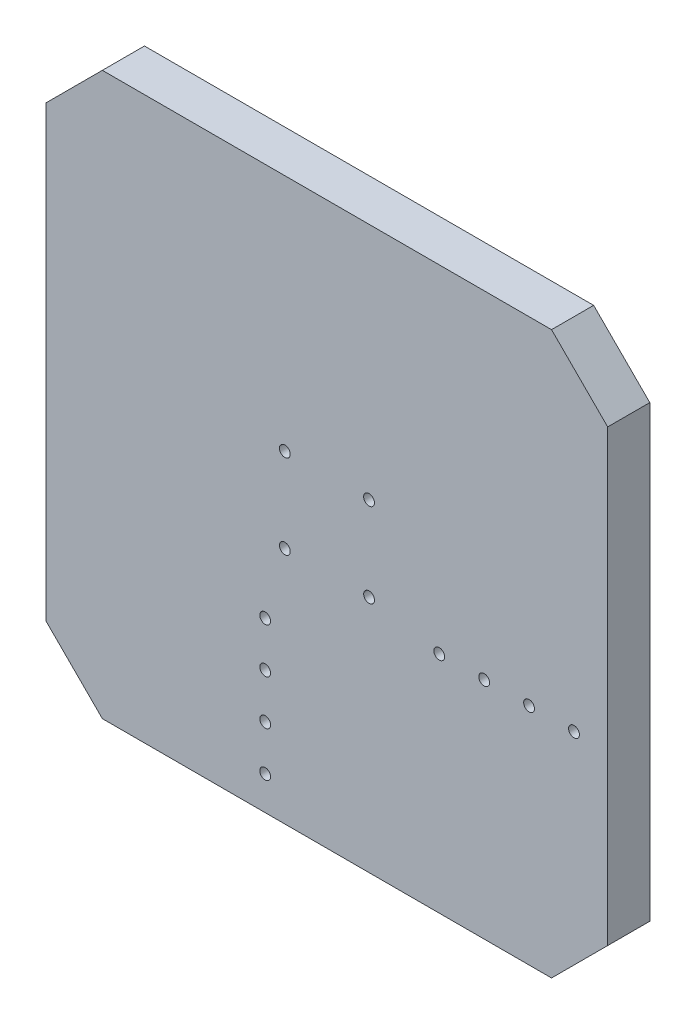
ISO-10303-21;
HEADER;
FILE_DESCRIPTION(('STEP AP214'),'2;1');
FILE_NAME('part.step','',(''),(''),'','','');
FILE_SCHEMA(('AUTOMOTIVE_DESIGN { 1 0 10303 214 1 1 1 1 }'));
ENDSEC;
DATA;
#1=APPLICATION_CONTEXT('core data for automotive mechanical design processes');
#2=APPLICATION_PROTOCOL_DEFINITION('international standard','automotive_design',2000,#1);
#3=PRODUCT_CONTEXT('',#1,'mechanical');
#4=PRODUCT('Part','Part','',(#3));
#5=PRODUCT_RELATED_PRODUCT_CATEGORY('part','',(#4));
#6=PRODUCT_DEFINITION_FORMATION('','',#4);
#7=PRODUCT_DEFINITION_CONTEXT('part definition',#1,'design');
#8=PRODUCT_DEFINITION('design','',#6,#7);
#9=PRODUCT_DEFINITION_SHAPE('','',#8);
#10=(LENGTH_UNIT() NAMED_UNIT(*) SI_UNIT(.MILLI.,.METRE.));
#11=(NAMED_UNIT(*) PLANE_ANGLE_UNIT() SI_UNIT($,.RADIAN.));
#12=(NAMED_UNIT(*) SI_UNIT($,.STERADIAN.) SOLID_ANGLE_UNIT());
#13=UNCERTAINTY_MEASURE_WITH_UNIT(LENGTH_MEASURE(1.E-05),#10,'distance_accuracy_value','');
#14=(GEOMETRIC_REPRESENTATION_CONTEXT(3) GLOBAL_UNCERTAINTY_ASSIGNED_CONTEXT((#13)) GLOBAL_UNIT_ASSIGNED_CONTEXT((#10,
#11,#12)) REPRESENTATION_CONTEXT('',''));
#15=CARTESIAN_POINT('',(0.,0.,0.));
#16=DIRECTION('',(0.,0.,1.));
#17=DIRECTION('',(1.,0.,0.));
#18=AXIS2_PLACEMENT_3D('',#15,#16,#17);
#19=CARTESIAN_POINT('',(100.,-100.,15.));
#20=DIRECTION('',(-1.,0.,0.));
#21=DIRECTION('',(0.,0.,1.));
#22=AXIS2_PLACEMENT_3D('',#19,#20,#21);
#23=PLANE('',#22);
#24=DIRECTION('',(0.,1.,0.));
#25=VECTOR('',#24,1.);
#26=CARTESIAN_POINT('',(100.,-100.,0.));
#27=LINE('',#26,#25);
#28=CARTESIAN_POINT('',(100.,-80.,0.));
#29=VERTEX_POINT('',#28);
#30=CARTESIAN_POINT('',(100.,80.,0.));
#31=VERTEX_POINT('',#30);
#32=EDGE_CURVE('E168',#29,#31,#27,.T.);
#33=ORIENTED_EDGE('',*,*,#32,.T.);
#34=DIRECTION('',(0.,0.,1.));
#35=VECTOR('',#34,1.);
#36=CARTESIAN_POINT('',(100.,80.,15.));
#37=LINE('',#36,#35);
#38=CARTESIAN_POINT('',(100.,80.,15.));
#39=VERTEX_POINT('',#38);
#40=EDGE_CURVE('E11',#31,#39,#37,.T.);
#41=ORIENTED_EDGE('',*,*,#40,.T.);
#42=DIRECTION('',(0.,1.,0.));
#43=VECTOR('',#42,1.);
#44=CARTESIAN_POINT('',(100.,-100.,15.));
#45=LINE('',#44,#43);
#46=CARTESIAN_POINT('',(100.,-80.,15.));
#47=VERTEX_POINT('',#46);
#48=EDGE_CURVE('E136',#47,#39,#45,.T.);
#49=ORIENTED_EDGE('',*,*,#48,.F.);
#50=DIRECTION('',(0.,0.,-1.));
#51=VECTOR('',#50,1.);
#52=CARTESIAN_POINT('',(100.,-80.,15.));
#53=LINE('',#52,#51);
#54=EDGE_CURVE('E52',#47,#29,#53,.T.);
#55=ORIENTED_EDGE('',*,*,#54,.T.);
#56=EDGE_LOOP('',(#33,#41,#49,#55));
#57=FACE_BOUND('',#56,.T.);
#58=ADVANCED_FACE('F43',(#57),#23,.F.);
#59=CARTESIAN_POINT('',(-100.,100.,15.));
#60=DIRECTION('',(0.,-1.,0.));
#61=DIRECTION('',(0.,0.,-1.));
#62=AXIS2_PLACEMENT_3D('',#59,#60,#61);
#63=PLANE('',#62);
#64=DIRECTION('',(-1.,0.,0.));
#65=VECTOR('',#64,1.);
#66=CARTESIAN_POINT('',(-100.,100.,0.));
#67=LINE('',#66,#65);
#68=CARTESIAN_POINT('',(80.,100.,0.));
#69=VERTEX_POINT('',#68);
#70=CARTESIAN_POINT('',(-79.9999999999999,100.,0.));
#71=VERTEX_POINT('',#70);
#72=EDGE_CURVE('E141',#69,#71,#67,.T.);
#73=ORIENTED_EDGE('',*,*,#72,.T.);
#74=DIRECTION('',(0.,0.,1.));
#75=VECTOR('',#74,1.);
#76=CARTESIAN_POINT('',(-79.9999999999999,100.,15.));
#77=LINE('',#76,#75);
#78=CARTESIAN_POINT('',(-79.9999999999999,100.,15.));
#79=VERTEX_POINT('',#78);
#80=EDGE_CURVE('E59',#71,#79,#77,.T.);
#81=ORIENTED_EDGE('',*,*,#80,.T.);
#82=DIRECTION('',(-1.,0.,0.));
#83=VECTOR('',#82,1.);
#84=CARTESIAN_POINT('',(-100.,100.,15.));
#85=LINE('',#84,#83);
#86=CARTESIAN_POINT('',(80.,100.,15.));
#87=VERTEX_POINT('',#86);
#88=EDGE_CURVE('E139',#87,#79,#85,.T.);
#89=ORIENTED_EDGE('',*,*,#88,.F.);
#90=DIRECTION('',(0.,0.,-1.));
#91=VECTOR('',#90,1.);
#92=CARTESIAN_POINT('',(80.,100.,15.));
#93=LINE('',#92,#91);
#94=EDGE_CURVE('E160',#87,#69,#93,.T.);
#95=ORIENTED_EDGE('',*,*,#94,.T.);
#96=EDGE_LOOP('',(#73,#81,#89,#95));
#97=FACE_BOUND('',#96,.T.);
#98=ADVANCED_FACE('F284',(#97),#63,.F.);
#99=CARTESIAN_POINT('',(-100.,-100.,15.));
#100=DIRECTION('',(1.,0.,0.));
#101=DIRECTION('',(0.,0.,-1.));
#102=AXIS2_PLACEMENT_3D('',#99,#100,#101);
#103=PLANE('',#102);
#104=DIRECTION('',(0.,-1.,0.));
#105=VECTOR('',#104,1.);
#106=CARTESIAN_POINT('',(-100.,-100.,0.));
#107=LINE('',#106,#105);
#108=CARTESIAN_POINT('',(-100.,80.,0.));
#109=VERTEX_POINT('',#108);
#110=CARTESIAN_POINT('',(-100.,-80.,0.));
#111=VERTEX_POINT('',#110);
#112=EDGE_CURVE('E137',#109,#111,#107,.T.);
#113=ORIENTED_EDGE('',*,*,#112,.T.);
#114=DIRECTION('',(0.,0.,1.));
#115=VECTOR('',#114,1.);
#116=CARTESIAN_POINT('',(-100.,-80.,15.));
#117=LINE('',#116,#115);
#118=CARTESIAN_POINT('',(-100.,-80.,15.));
#119=VERTEX_POINT('',#118);
#120=EDGE_CURVE('E115',#111,#119,#117,.T.);
#121=ORIENTED_EDGE('',*,*,#120,.T.);
#122=DIRECTION('',(0.,-1.,0.));
#123=VECTOR('',#122,1.);
#124=CARTESIAN_POINT('',(-100.,-100.,15.));
#125=LINE('',#124,#123);
#126=CARTESIAN_POINT('',(-100.,80.,15.));
#127=VERTEX_POINT('',#126);
#128=EDGE_CURVE('E180',#127,#119,#125,.T.);
#129=ORIENTED_EDGE('',*,*,#128,.F.);
#130=DIRECTION('',(0.,0.,-1.));
#131=VECTOR('',#130,1.);
#132=CARTESIAN_POINT('',(-100.,80.,15.));
#133=LINE('',#132,#131);
#134=EDGE_CURVE('E120',#127,#109,#133,.T.);
#135=ORIENTED_EDGE('',*,*,#134,.T.);
#136=EDGE_LOOP('',(#113,#121,#129,#135));
#137=FACE_BOUND('',#136,.T.);
#138=ADVANCED_FACE('F281',(#137),#103,.F.);
#139=CARTESIAN_POINT('',(-100.,-100.,15.));
#140=DIRECTION('',(0.,1.,0.));
#141=DIRECTION('',(0.,0.,1.));
#142=AXIS2_PLACEMENT_3D('',#139,#140,#141);
#143=PLANE('',#142);
#144=DIRECTION('',(1.,0.,0.));
#145=VECTOR('',#144,1.);
#146=CARTESIAN_POINT('',(-100.,-100.,15.));
#147=LINE('',#146,#145);
#148=CARTESIAN_POINT('',(-80.,-100.,15.));
#149=VERTEX_POINT('',#148);
#150=CARTESIAN_POINT('',(79.9999999999999,-100.,15.));
#151=VERTEX_POINT('',#150);
#152=EDGE_CURVE('E130',#149,#151,#147,.T.);
#153=ORIENTED_EDGE('',*,*,#152,.F.);
#154=DIRECTION('',(0.,0.,-1.));
#155=VECTOR('',#154,1.);
#156=CARTESIAN_POINT('',(-80.,-100.,15.));
#157=LINE('',#156,#155);
#158=CARTESIAN_POINT('',(-80.,-100.,0.));
#159=VERTEX_POINT('',#158);
#160=EDGE_CURVE('E114',#149,#159,#157,.T.);
#161=ORIENTED_EDGE('',*,*,#160,.T.);
#162=DIRECTION('',(1.,0.,0.));
#163=VECTOR('',#162,1.);
#164=CARTESIAN_POINT('',(-100.,-100.,0.));
#165=LINE('',#164,#163);
#166=CARTESIAN_POINT('',(79.9999999999999,-100.,0.));
#167=VERTEX_POINT('',#166);
#168=EDGE_CURVE('E127',#159,#167,#165,.T.);
#169=ORIENTED_EDGE('',*,*,#168,.T.);
#170=DIRECTION('',(0.,0.,1.));
#171=VECTOR('',#170,1.);
#172=CARTESIAN_POINT('',(79.9999999999999,-100.,15.));
#173=LINE('',#172,#171);
#174=EDGE_CURVE('E132',#167,#151,#173,.T.);
#175=ORIENTED_EDGE('',*,*,#174,.T.);
#176=EDGE_LOOP('',(#153,#161,#169,#175));
#177=FACE_BOUND('',#176,.T.);
#178=ADVANCED_FACE('F126',(#177),#143,.F.);
#179=CARTESIAN_POINT('',(0.,0.,15.));
#180=DIRECTION('',(0.,0.,-1.));
#181=DIRECTION('',(-1.,0.,0.));
#182=AXIS2_PLACEMENT_3D('',#179,#180,#181);
#183=PLANE('',#182);
#184=CARTESIAN_POINT('',(-15.,15.,15.));
#185=DIRECTION('',(0.,0.,1.));
#186=DIRECTION('',(-1.,0.,0.));
#187=AXIS2_PLACEMENT_3D('',#184,#185,#186);
#188=CIRCLE('',#187,1.92500000000001);
#189=CARTESIAN_POINT('',(-16.925,15.,15.));
#190=VERTEX_POINT('',#189);
#191=EDGE_CURVE('E238',#190,#190,#188,.T.);
#192=ORIENTED_EDGE('',*,*,#191,.F.);
#193=EDGE_LOOP('',(#192));
#194=FACE_BOUND('',#193,.T.);
#195=CARTESIAN_POINT('',(-15.,-15.,15.));
#196=DIRECTION('',(0.,0.,1.));
#197=DIRECTION('',(1.,0.,0.));
#198=AXIS2_PLACEMENT_3D('',#195,#196,#197);
#199=CIRCLE('',#198,1.92499999999999);
#200=CARTESIAN_POINT('',(-13.075,-15.,15.));
#201=VERTEX_POINT('',#200);
#202=EDGE_CURVE('E244',#201,#201,#199,.T.);
#203=ORIENTED_EDGE('',*,*,#202,.F.);
#204=EDGE_LOOP('',(#203));
#205=FACE_BOUND('',#204,.T.);
#206=CARTESIAN_POINT('',(15.,-15.,15.));
#207=DIRECTION('',(0.,0.,1.));
#208=DIRECTION('',(-1.,0.,0.));
#209=AXIS2_PLACEMENT_3D('',#206,#207,#208);
#210=CIRCLE('',#209,1.925);
#211=CARTESIAN_POINT('',(13.075,-15.,15.));
#212=VERTEX_POINT('',#211);
#213=EDGE_CURVE('E232',#212,#212,#210,.T.);
#214=ORIENTED_EDGE('',*,*,#213,.F.);
#215=EDGE_LOOP('',(#214));
#216=FACE_BOUND('',#215,.T.);
#217=CARTESIAN_POINT('',(15.,15.,15.));
#218=DIRECTION('',(0.,0.,1.));
#219=DIRECTION('',(1.,0.,0.));
#220=AXIS2_PLACEMENT_3D('',#217,#218,#219);
#221=CIRCLE('',#220,1.925);
#222=CARTESIAN_POINT('',(16.925,15.,15.));
#223=VERTEX_POINT('',#222);
#224=EDGE_CURVE('E229',#223,#223,#221,.T.);
#225=ORIENTED_EDGE('',*,*,#224,.F.);
#226=EDGE_LOOP('',(#225));
#227=FACE_BOUND('',#226,.T.);
#228=CARTESIAN_POINT('',(88.,-20.,15.));
#229=DIRECTION('',(0.,0.,1.));
#230=DIRECTION('',(1.,0.,0.));
#231=AXIS2_PLACEMENT_3D('',#228,#229,#230);
#232=CIRCLE('',#231,1.925);
#233=CARTESIAN_POINT('',(89.925,-20.,15.));
#234=VERTEX_POINT('',#233);
#235=EDGE_CURVE('E224',#234,#234,#232,.T.);
#236=ORIENTED_EDGE('',*,*,#235,.F.);
#237=EDGE_LOOP('',(#236));
#238=FACE_BOUND('',#237,.T.);
#239=CARTESIAN_POINT('',(72.,-20.0000000000001,15.));
#240=DIRECTION('',(0.,0.,1.));
#241=DIRECTION('',(1.,0.,0.));
#242=AXIS2_PLACEMENT_3D('',#239,#240,#241);
#243=CIRCLE('',#242,1.925);
#244=CARTESIAN_POINT('',(73.925,-20.0000000000001,15.));
#245=VERTEX_POINT('',#244);
#246=EDGE_CURVE('E221',#245,#245,#243,.T.);
#247=ORIENTED_EDGE('',*,*,#246,.F.);
#248=EDGE_LOOP('',(#247));
#249=FACE_BOUND('',#248,.T.);
#250=CARTESIAN_POINT('',(56.,-20.0000000000002,15.));
#251=DIRECTION('',(0.,0.,1.));
#252=DIRECTION('',(1.,0.,0.));
#253=AXIS2_PLACEMENT_3D('',#250,#251,#252);
#254=CIRCLE('',#253,1.925);
#255=CARTESIAN_POINT('',(57.925,-20.0000000000002,15.));
#256=VERTEX_POINT('',#255);
#257=EDGE_CURVE('E215',#256,#256,#254,.T.);
#258=ORIENTED_EDGE('',*,*,#257,.F.);
#259=EDGE_LOOP('',(#258));
#260=FACE_BOUND('',#259,.T.);
#261=CARTESIAN_POINT('',(40.,-20.0000000000004,15.));
#262=DIRECTION('',(0.,0.,1.));
#263=DIRECTION('',(1.,0.,0.));
#264=AXIS2_PLACEMENT_3D('',#261,#262,#263);
#265=CIRCLE('',#264,1.925);
#266=CARTESIAN_POINT('',(41.925,-20.0000000000004,15.));
#267=VERTEX_POINT('',#266);
#268=EDGE_CURVE('E208',#267,#267,#265,.T.);
#269=ORIENTED_EDGE('',*,*,#268,.F.);
#270=EDGE_LOOP('',(#269));
#271=FACE_BOUND('',#270,.T.);
#272=CARTESIAN_POINT('',(-22.,-88.,15.));
#273=DIRECTION('',(0.,0.,1.));
#274=DIRECTION('',(1.,0.,0.));
#275=AXIS2_PLACEMENT_3D('',#272,#273,#274);
#276=CIRCLE('',#275,1.925);
#277=CARTESIAN_POINT('',(-20.075,-88.,15.));
#278=VERTEX_POINT('',#277);
#279=EDGE_CURVE('E176',#278,#278,#276,.T.);
#280=ORIENTED_EDGE('',*,*,#279,.F.);
#281=EDGE_LOOP('',(#280));
#282=FACE_BOUND('',#281,.T.);
#283=CARTESIAN_POINT('',(-22.,-72.,15.));
#284=DIRECTION('',(0.,0.,1.));
#285=DIRECTION('',(1.,0.,0.));
#286=AXIS2_PLACEMENT_3D('',#283,#284,#285);
#287=CIRCLE('',#286,1.925);
#288=CARTESIAN_POINT('',(-20.075,-72.,15.));
#289=VERTEX_POINT('',#288);
#290=EDGE_CURVE('E200',#289,#289,#287,.T.);
#291=ORIENTED_EDGE('',*,*,#290,.F.);
#292=EDGE_LOOP('',(#291));
#293=FACE_BOUND('',#292,.T.);
#294=CARTESIAN_POINT('',(-22.,-56.,15.));
#295=DIRECTION('',(0.,0.,1.));
#296=DIRECTION('',(1.,0.,0.));
#297=AXIS2_PLACEMENT_3D('',#294,#295,#296);
#298=CIRCLE('',#297,1.925);
#299=CARTESIAN_POINT('',(-20.075,-56.,15.));
#300=VERTEX_POINT('',#299);
#301=EDGE_CURVE('E194',#300,#300,#298,.T.);
#302=ORIENTED_EDGE('',*,*,#301,.F.);
#303=EDGE_LOOP('',(#302));
#304=FACE_BOUND('',#303,.T.);
#305=CARTESIAN_POINT('',(-22.,-40.,15.));
#306=DIRECTION('',(0.,0.,1.));
#307=DIRECTION('',(1.,0.,0.));
#308=AXIS2_PLACEMENT_3D('',#305,#306,#307);
#309=CIRCLE('',#308,1.925);
#310=CARTESIAN_POINT('',(-20.075,-40.,15.));
#311=VERTEX_POINT('',#310);
#312=EDGE_CURVE('E187',#311,#311,#309,.T.);
#313=ORIENTED_EDGE('',*,*,#312,.F.);
#314=EDGE_LOOP('',(#313));
#315=FACE_BOUND('',#314,.T.);
#316=ORIENTED_EDGE('',*,*,#128,.T.);
#317=DIRECTION('',(-0.707106781186547,0.707106781186549,0.));
#318=VECTOR('',#317,1.);
#319=CARTESIAN_POINT('',(-80.,-100.,15.));
#320=LINE('',#319,#318);
#321=EDGE_CURVE('E158',#119,#149,#320,.F.);
#322=ORIENTED_EDGE('',*,*,#321,.T.);
#323=ORIENTED_EDGE('',*,*,#152,.T.);
#324=DIRECTION('',(-0.707106781186549,-0.707106781186547,0.));
#325=VECTOR('',#324,1.);
#326=CARTESIAN_POINT('',(100.,-80.,15.));
#327=LINE('',#326,#325);
#328=EDGE_CURVE('E153',#151,#47,#327,.F.);
#329=ORIENTED_EDGE('',*,*,#328,.T.);
#330=ORIENTED_EDGE('',*,*,#48,.T.);
#331=DIRECTION('',(0.707106781186547,-0.707106781186549,0.));
#332=VECTOR('',#331,1.);
#333=CARTESIAN_POINT('',(80.,100.,15.));
#334=LINE('',#333,#332);
#335=EDGE_CURVE('E66',#39,#87,#334,.F.);
#336=ORIENTED_EDGE('',*,*,#335,.T.);
#337=ORIENTED_EDGE('',*,*,#88,.T.);
#338=DIRECTION('',(0.707106781186549,0.707106781186547,0.));
#339=VECTOR('',#338,1.);
#340=CARTESIAN_POINT('',(-100.,80.,15.));
#341=LINE('',#340,#339);
#342=EDGE_CURVE('E156',#79,#127,#341,.F.);
#343=ORIENTED_EDGE('',*,*,#342,.T.);
#344=EDGE_LOOP('',(#316,#322,#323,#329,#330,#336,#337,#343));
#345=FACE_BOUND('',#344,.T.);
#346=ADVANCED_FACE('F255',(#194,#205,#216,#227,#238,#249,#260,#271,#282,#293,#304,#315,#345),
#183,.F.);
#347=CARTESIAN_POINT('',(0.,0.,0.));
#348=DIRECTION('',(0.,0.,-1.));
#349=DIRECTION('',(-1.,0.,0.));
#350=AXIS2_PLACEMENT_3D('',#347,#348,#349);
#351=PLANE('',#350);
#352=CARTESIAN_POINT('',(-15.,15.,0.));
#353=DIRECTION('',(0.,0.,1.));
#354=DIRECTION('',(-1.,0.,0.));
#355=AXIS2_PLACEMENT_3D('',#352,#353,#354);
#356=CIRCLE('',#355,1.92500000000001);
#357=CARTESIAN_POINT('',(-16.925,15.,0.));
#358=VERTEX_POINT('',#357);
#359=EDGE_CURVE('E235',#358,#358,#356,.T.);
#360=ORIENTED_EDGE('',*,*,#359,.T.);
#361=EDGE_LOOP('',(#360));
#362=FACE_BOUND('',#361,.T.);
#363=CARTESIAN_POINT('',(-15.,-15.,0.));
#364=DIRECTION('',(0.,0.,1.));
#365=DIRECTION('',(1.,0.,0.));
#366=AXIS2_PLACEMENT_3D('',#363,#364,#365);
#367=CIRCLE('',#366,1.92499999999999);
#368=CARTESIAN_POINT('',(-13.075,-15.,0.));
#369=VERTEX_POINT('',#368);
#370=EDGE_CURVE('E241',#369,#369,#367,.T.);
#371=ORIENTED_EDGE('',*,*,#370,.T.);
#372=EDGE_LOOP('',(#371));
#373=FACE_BOUND('',#372,.T.);
#374=CARTESIAN_POINT('',(15.,-15.,0.));
#375=DIRECTION('',(0.,0.,1.));
#376=DIRECTION('',(-1.,0.,0.));
#377=AXIS2_PLACEMENT_3D('',#374,#375,#376);
#378=CIRCLE('',#377,1.925);
#379=CARTESIAN_POINT('',(13.075,-15.,0.));
#380=VERTEX_POINT('',#379);
#381=EDGE_CURVE('E247',#380,#380,#378,.T.);
#382=ORIENTED_EDGE('',*,*,#381,.T.);
#383=EDGE_LOOP('',(#382));
#384=FACE_BOUND('',#383,.T.);
#385=CARTESIAN_POINT('',(15.,15.,0.));
#386=DIRECTION('',(0.,0.,1.));
#387=DIRECTION('',(1.,0.,0.));
#388=AXIS2_PLACEMENT_3D('',#385,#386,#387);
#389=CIRCLE('',#388,1.925);
#390=CARTESIAN_POINT('',(16.925,15.,0.));
#391=VERTEX_POINT('',#390);
#392=EDGE_CURVE('E209',#391,#391,#389,.T.);
#393=ORIENTED_EDGE('',*,*,#392,.T.);
#394=EDGE_LOOP('',(#393));
#395=FACE_BOUND('',#394,.T.);
#396=CARTESIAN_POINT('',(88.,-20.,0.));
#397=DIRECTION('',(0.,0.,1.));
#398=DIRECTION('',(1.,0.,0.));
#399=AXIS2_PLACEMENT_3D('',#396,#397,#398);
#400=CIRCLE('',#399,1.925);
#401=CARTESIAN_POINT('',(89.925,-20.,0.));
#402=VERTEX_POINT('',#401);
#403=EDGE_CURVE('E188',#402,#402,#400,.T.);
#404=ORIENTED_EDGE('',*,*,#403,.T.);
#405=EDGE_LOOP('',(#404));
#406=FACE_BOUND('',#405,.T.);
#407=CARTESIAN_POINT('',(72.,-20.0000000000001,0.));
#408=DIRECTION('',(0.,0.,1.));
#409=DIRECTION('',(1.,0.,0.));
#410=AXIS2_PLACEMENT_3D('',#407,#408,#409);
#411=CIRCLE('',#410,1.925);
#412=CARTESIAN_POINT('',(73.925,-20.0000000000001,0.));
#413=VERTEX_POINT('',#412);
#414=EDGE_CURVE('E218',#413,#413,#411,.T.);
#415=ORIENTED_EDGE('',*,*,#414,.T.);
#416=EDGE_LOOP('',(#415));
#417=FACE_BOUND('',#416,.T.);
#418=CARTESIAN_POINT('',(56.,-20.0000000000002,0.));
#419=DIRECTION('',(0.,0.,1.));
#420=DIRECTION('',(1.,0.,0.));
#421=AXIS2_PLACEMENT_3D('',#418,#419,#420);
#422=CIRCLE('',#421,1.925);
#423=CARTESIAN_POINT('',(57.925,-20.0000000000002,0.));
#424=VERTEX_POINT('',#423);
#425=EDGE_CURVE('E212',#424,#424,#422,.T.);
#426=ORIENTED_EDGE('',*,*,#425,.T.);
#427=EDGE_LOOP('',(#426));
#428=FACE_BOUND('',#427,.T.);
#429=CARTESIAN_POINT('',(40.,-20.0000000000004,0.));
#430=DIRECTION('',(0.,0.,1.));
#431=DIRECTION('',(1.,0.,0.));
#432=AXIS2_PLACEMENT_3D('',#429,#430,#431);
#433=CIRCLE('',#432,1.925);
#434=CARTESIAN_POINT('',(41.925,-20.0000000000004,0.));
#435=VERTEX_POINT('',#434);
#436=EDGE_CURVE('E205',#435,#435,#433,.T.);
#437=ORIENTED_EDGE('',*,*,#436,.T.);
#438=EDGE_LOOP('',(#437));
#439=FACE_BOUND('',#438,.T.);
#440=CARTESIAN_POINT('',(-22.,-88.,0.));
#441=DIRECTION('',(0.,0.,1.));
#442=DIRECTION('',(1.,0.,0.));
#443=AXIS2_PLACEMENT_3D('',#440,#441,#442);
#444=CIRCLE('',#443,1.925);
#445=CARTESIAN_POINT('',(-20.075,-88.,0.));
#446=VERTEX_POINT('',#445);
#447=EDGE_CURVE('E173',#446,#446,#444,.T.);
#448=ORIENTED_EDGE('',*,*,#447,.T.);
#449=EDGE_LOOP('',(#448));
#450=FACE_BOUND('',#449,.T.);
#451=CARTESIAN_POINT('',(-22.,-72.,0.));
#452=DIRECTION('',(0.,0.,1.));
#453=DIRECTION('',(1.,0.,0.));
#454=AXIS2_PLACEMENT_3D('',#451,#452,#453);
#455=CIRCLE('',#454,1.925);
#456=CARTESIAN_POINT('',(-20.075,-72.,0.));
#457=VERTEX_POINT('',#456);
#458=EDGE_CURVE('E197',#457,#457,#455,.T.);
#459=ORIENTED_EDGE('',*,*,#458,.T.);
#460=EDGE_LOOP('',(#459));
#461=FACE_BOUND('',#460,.T.);
#462=CARTESIAN_POINT('',(-22.,-56.,0.));
#463=DIRECTION('',(0.,0.,1.));
#464=DIRECTION('',(1.,0.,0.));
#465=AXIS2_PLACEMENT_3D('',#462,#463,#464);
#466=CIRCLE('',#465,1.925);
#467=CARTESIAN_POINT('',(-20.075,-56.,0.));
#468=VERTEX_POINT('',#467);
#469=EDGE_CURVE('E191',#468,#468,#466,.T.);
#470=ORIENTED_EDGE('',*,*,#469,.T.);
#471=EDGE_LOOP('',(#470));
#472=FACE_BOUND('',#471,.T.);
#473=CARTESIAN_POINT('',(-22.,-40.,0.));
#474=DIRECTION('',(0.,0.,1.));
#475=DIRECTION('',(1.,0.,0.));
#476=AXIS2_PLACEMENT_3D('',#473,#474,#475);
#477=CIRCLE('',#476,1.925);
#478=CARTESIAN_POINT('',(-20.075,-40.,0.));
#479=VERTEX_POINT('',#478);
#480=EDGE_CURVE('E184',#479,#479,#477,.T.);
#481=ORIENTED_EDGE('',*,*,#480,.T.);
#482=EDGE_LOOP('',(#481));
#483=FACE_BOUND('',#482,.T.);
#484=ORIENTED_EDGE('',*,*,#168,.F.);
#485=DIRECTION('',(0.707106781186547,-0.707106781186549,0.));
#486=VECTOR('',#485,1.);
#487=CARTESIAN_POINT('',(-90.0000000000001,-89.9999999999999,0.));
#488=LINE('',#487,#486);
#489=EDGE_CURVE('E110',#159,#111,#488,.F.);
#490=ORIENTED_EDGE('',*,*,#489,.T.);
#491=ORIENTED_EDGE('',*,*,#112,.F.);
#492=DIRECTION('',(-0.707106781186549,-0.707106781186547,0.));
#493=VECTOR('',#492,1.);
#494=CARTESIAN_POINT('',(-89.9999999999999,90.0000000000001,0.));
#495=LINE('',#494,#493);
#496=EDGE_CURVE('E121',#109,#71,#495,.F.);
#497=ORIENTED_EDGE('',*,*,#496,.T.);
#498=ORIENTED_EDGE('',*,*,#72,.F.);
#499=DIRECTION('',(-0.707106781186547,0.707106781186549,0.));
#500=VECTOR('',#499,1.);
#501=CARTESIAN_POINT('',(90.0000000000001,89.9999999999999,0.));
#502=LINE('',#501,#500);
#503=EDGE_CURVE('E147',#69,#31,#502,.F.);
#504=ORIENTED_EDGE('',*,*,#503,.T.);
#505=ORIENTED_EDGE('',*,*,#32,.F.);
#506=DIRECTION('',(0.707106781186549,0.707106781186547,0.));
#507=VECTOR('',#506,1.);
#508=CARTESIAN_POINT('',(89.9999999999999,-90.0000000000001,0.));
#509=LINE('',#508,#507);
#510=EDGE_CURVE('E131',#29,#167,#509,.F.);
#511=ORIENTED_EDGE('',*,*,#510,.T.);
#512=EDGE_LOOP('',(#484,#490,#491,#497,#498,#504,#505,#511));
#513=FACE_BOUND('',#512,.T.);
#514=ADVANCED_FACE('F134',(#362,#373,#384,#395,#406,#417,#428,#439,#450,#461,#472,#483,#513),
#351,.T.);
#515=CARTESIAN_POINT('',(-80.,-100.,15.));
#516=DIRECTION('',(0.707106781186548,0.707106781186546,0.));
#517=DIRECTION('',(0.,0.,-1.));
#518=AXIS2_PLACEMENT_3D('',#515,#516,#517);
#519=PLANE('',#518);
#520=ORIENTED_EDGE('',*,*,#321,.F.);
#521=ORIENTED_EDGE('',*,*,#120,.F.);
#522=ORIENTED_EDGE('',*,*,#489,.F.);
#523=ORIENTED_EDGE('',*,*,#160,.F.);
#524=EDGE_LOOP('',(#520,#521,#522,#523));
#525=FACE_BOUND('',#524,.T.);
#526=ADVANCED_FACE('F113',(#525),#519,.F.);
#527=CARTESIAN_POINT('',(-100.,80.,15.));
#528=DIRECTION('',(0.707106781186547,-0.707106781186549,0.));
#529=DIRECTION('',(0.,0.,-1.));
#530=AXIS2_PLACEMENT_3D('',#527,#528,#529);
#531=PLANE('',#530);
#532=ORIENTED_EDGE('',*,*,#342,.F.);
#533=ORIENTED_EDGE('',*,*,#80,.F.);
#534=ORIENTED_EDGE('',*,*,#496,.F.);
#535=ORIENTED_EDGE('',*,*,#134,.F.);
#536=EDGE_LOOP('',(#532,#533,#534,#535));
#537=FACE_BOUND('',#536,.T.);
#538=ADVANCED_FACE('F283',(#537),#531,.F.);
#539=CARTESIAN_POINT('',(80.,100.,15.));
#540=DIRECTION('',(-0.707106781186548,-0.707106781186546,0.));
#541=DIRECTION('',(0.,0.,-1.));
#542=AXIS2_PLACEMENT_3D('',#539,#540,#541);
#543=PLANE('',#542);
#544=ORIENTED_EDGE('',*,*,#335,.F.);
#545=ORIENTED_EDGE('',*,*,#40,.F.);
#546=ORIENTED_EDGE('',*,*,#503,.F.);
#547=ORIENTED_EDGE('',*,*,#94,.F.);
#548=EDGE_LOOP('',(#544,#545,#546,#547));
#549=FACE_BOUND('',#548,.T.);
#550=ADVANCED_FACE('F287',(#549),#543,.F.);
#551=CARTESIAN_POINT('',(100.,-80.,15.));
#552=DIRECTION('',(-0.707106781186547,0.707106781186549,0.));
#553=DIRECTION('',(0.,0.,-1.));
#554=AXIS2_PLACEMENT_3D('',#551,#552,#553);
#555=PLANE('',#554);
#556=ORIENTED_EDGE('',*,*,#328,.F.);
#557=ORIENTED_EDGE('',*,*,#174,.F.);
#558=ORIENTED_EDGE('',*,*,#510,.F.);
#559=ORIENTED_EDGE('',*,*,#54,.F.);
#560=EDGE_LOOP('',(#556,#557,#558,#559));
#561=FACE_BOUND('',#560,.T.);
#562=ADVANCED_FACE('F46',(#561),#555,.F.);
#563=CARTESIAN_POINT('',(-22.,-40.,0.));
#564=DIRECTION('',(0.,0.,1.));
#565=DIRECTION('',(1.,0.,0.));
#566=AXIS2_PLACEMENT_3D('',#563,#564,#565);
#567=CYLINDRICAL_SURFACE('',#566,1.925);
#568=ORIENTED_EDGE('',*,*,#480,.F.);
#569=EDGE_LOOP('',(#568));
#570=FACE_BOUND('',#569,.T.);
#571=ORIENTED_EDGE('',*,*,#312,.T.);
#572=EDGE_LOOP('',(#571));
#573=FACE_BOUND('',#572,.T.);
#574=ADVANCED_FACE('F289',(#570,#573),#567,.F.);
#575=CARTESIAN_POINT('',(-22.,-56.,0.));
#576=DIRECTION('',(0.,0.,1.));
#577=DIRECTION('',(1.,0.,0.));
#578=AXIS2_PLACEMENT_3D('',#575,#576,#577);
#579=CYLINDRICAL_SURFACE('',#578,1.925);
#580=ORIENTED_EDGE('',*,*,#469,.F.);
#581=EDGE_LOOP('',(#580));
#582=FACE_BOUND('',#581,.T.);
#583=ORIENTED_EDGE('',*,*,#301,.T.);
#584=EDGE_LOOP('',(#583));
#585=FACE_BOUND('',#584,.T.);
#586=ADVANCED_FACE('F294',(#582,#585),#579,.F.);
#587=CARTESIAN_POINT('',(-22.,-72.,0.));
#588=DIRECTION('',(0.,0.,1.));
#589=DIRECTION('',(1.,0.,0.));
#590=AXIS2_PLACEMENT_3D('',#587,#588,#589);
#591=CYLINDRICAL_SURFACE('',#590,1.925);
#592=ORIENTED_EDGE('',*,*,#458,.F.);
#593=EDGE_LOOP('',(#592));
#594=FACE_BOUND('',#593,.T.);
#595=ORIENTED_EDGE('',*,*,#290,.T.);
#596=EDGE_LOOP('',(#595));
#597=FACE_BOUND('',#596,.T.);
#598=ADVANCED_FACE('F349',(#594,#597),#591,.F.);
#599=CARTESIAN_POINT('',(-22.,-88.,0.));
#600=DIRECTION('',(0.,0.,1.));
#601=DIRECTION('',(1.,0.,0.));
#602=AXIS2_PLACEMENT_3D('',#599,#600,#601);
#603=CYLINDRICAL_SURFACE('',#602,1.925);
#604=ORIENTED_EDGE('',*,*,#447,.F.);
#605=EDGE_LOOP('',(#604));
#606=FACE_BOUND('',#605,.T.);
#607=ORIENTED_EDGE('',*,*,#279,.T.);
#608=EDGE_LOOP('',(#607));
#609=FACE_BOUND('',#608,.T.);
#610=ADVANCED_FACE('F359',(#606,#609),#603,.F.);
#611=CARTESIAN_POINT('',(40.,-20.0000000000004,0.));
#612=DIRECTION('',(0.,0.,1.));
#613=DIRECTION('',(1.,0.,0.));
#614=AXIS2_PLACEMENT_3D('',#611,#612,#613);
#615=CYLINDRICAL_SURFACE('',#614,1.925);
#616=ORIENTED_EDGE('',*,*,#436,.F.);
#617=EDGE_LOOP('',(#616));
#618=FACE_BOUND('',#617,.T.);
#619=ORIENTED_EDGE('',*,*,#268,.T.);
#620=EDGE_LOOP('',(#619));
#621=FACE_BOUND('',#620,.T.);
#622=ADVANCED_FACE('F369',(#618,#621),#615,.F.);
#623=CARTESIAN_POINT('',(56.,-20.0000000000002,0.));
#624=DIRECTION('',(0.,0.,1.));
#625=DIRECTION('',(1.,0.,0.));
#626=AXIS2_PLACEMENT_3D('',#623,#624,#625);
#627=CYLINDRICAL_SURFACE('',#626,1.925);
#628=ORIENTED_EDGE('',*,*,#425,.F.);
#629=EDGE_LOOP('',(#628));
#630=FACE_BOUND('',#629,.T.);
#631=ORIENTED_EDGE('',*,*,#257,.T.);
#632=EDGE_LOOP('',(#631));
#633=FACE_BOUND('',#632,.T.);
#634=ADVANCED_FACE('F379',(#630,#633),#627,.F.);
#635=CARTESIAN_POINT('',(72.,-20.0000000000001,0.));
#636=DIRECTION('',(0.,0.,1.));
#637=DIRECTION('',(1.,0.,0.));
#638=AXIS2_PLACEMENT_3D('',#635,#636,#637);
#639=CYLINDRICAL_SURFACE('',#638,1.925);
#640=ORIENTED_EDGE('',*,*,#414,.F.);
#641=EDGE_LOOP('',(#640));
#642=FACE_BOUND('',#641,.T.);
#643=ORIENTED_EDGE('',*,*,#246,.T.);
#644=EDGE_LOOP('',(#643));
#645=FACE_BOUND('',#644,.T.);
#646=ADVANCED_FACE('F389',(#642,#645),#639,.F.);
#647=CARTESIAN_POINT('',(88.,-20.,0.));
#648=DIRECTION('',(0.,0.,1.));
#649=DIRECTION('',(1.,0.,0.));
#650=AXIS2_PLACEMENT_3D('',#647,#648,#649);
#651=CYLINDRICAL_SURFACE('',#650,1.925);
#652=ORIENTED_EDGE('',*,*,#403,.F.);
#653=EDGE_LOOP('',(#652));
#654=FACE_BOUND('',#653,.T.);
#655=ORIENTED_EDGE('',*,*,#235,.T.);
#656=EDGE_LOOP('',(#655));
#657=FACE_BOUND('',#656,.T.);
#658=ADVANCED_FACE('F399',(#654,#657),#651,.F.);
#659=CARTESIAN_POINT('',(15.,15.,0.));
#660=DIRECTION('',(0.,0.,1.));
#661=DIRECTION('',(1.,0.,0.));
#662=AXIS2_PLACEMENT_3D('',#659,#660,#661);
#663=CYLINDRICAL_SURFACE('',#662,1.925);
#664=ORIENTED_EDGE('',*,*,#392,.F.);
#665=EDGE_LOOP('',(#664));
#666=FACE_BOUND('',#665,.T.);
#667=ORIENTED_EDGE('',*,*,#224,.T.);
#668=EDGE_LOOP('',(#667));
#669=FACE_BOUND('',#668,.T.);
#670=ADVANCED_FACE('F409',(#666,#669),#663,.F.);
#671=CARTESIAN_POINT('',(15.,-15.,0.));
#672=DIRECTION('',(0.,0.,1.));
#673=DIRECTION('',(1.,0.,0.));
#674=AXIS2_PLACEMENT_3D('',#671,#672,#673);
#675=CYLINDRICAL_SURFACE('',#674,1.925);
#676=ORIENTED_EDGE('',*,*,#381,.F.);
#677=EDGE_LOOP('',(#676));
#678=FACE_BOUND('',#677,.T.);
#679=ORIENTED_EDGE('',*,*,#213,.T.);
#680=EDGE_LOOP('',(#679));
#681=FACE_BOUND('',#680,.T.);
#682=ADVANCED_FACE('F253',(#678,#681),#675,.F.);
#683=CARTESIAN_POINT('',(-15.,-15.,0.));
#684=DIRECTION('',(0.,0.,1.));
#685=DIRECTION('',(1.,0.,0.));
#686=AXIS2_PLACEMENT_3D('',#683,#684,#685);
#687=CYLINDRICAL_SURFACE('',#686,1.92499999999999);
#688=ORIENTED_EDGE('',*,*,#370,.F.);
#689=EDGE_LOOP('',(#688));
#690=FACE_BOUND('',#689,.T.);
#691=ORIENTED_EDGE('',*,*,#202,.T.);
#692=EDGE_LOOP('',(#691));
#693=FACE_BOUND('',#692,.T.);
#694=ADVANCED_FACE('F429',(#690,#693),#687,.F.);
#695=CARTESIAN_POINT('',(-15.,15.,0.));
#696=DIRECTION('',(0.,0.,1.));
#697=DIRECTION('',(1.,0.,0.));
#698=AXIS2_PLACEMENT_3D('',#695,#696,#697);
#699=CYLINDRICAL_SURFACE('',#698,1.92500000000001);
#700=ORIENTED_EDGE('',*,*,#359,.F.);
#701=EDGE_LOOP('',(#700));
#702=FACE_BOUND('',#701,.T.);
#703=ORIENTED_EDGE('',*,*,#191,.T.);
#704=EDGE_LOOP('',(#703));
#705=FACE_BOUND('',#704,.T.);
#706=ADVANCED_FACE('F439',(#702,#705),#699,.F.);
#707=CLOSED_SHELL('',(#58,#98,#138,#178,#346,#514,#526,#538,#550,#562,#574,#586,#598,#610,#622,
#634,#646,#658,#670,#682,#694,#706));
#708=MANIFOLD_SOLID_BREP('B2',#707);
#709=ADVANCED_BREP_SHAPE_REPRESENTATION('',(#18,#708),#14);
#710=SHAPE_DEFINITION_REPRESENTATION(#9,#709);
ENDSEC;
END-ISO-10303-21;
